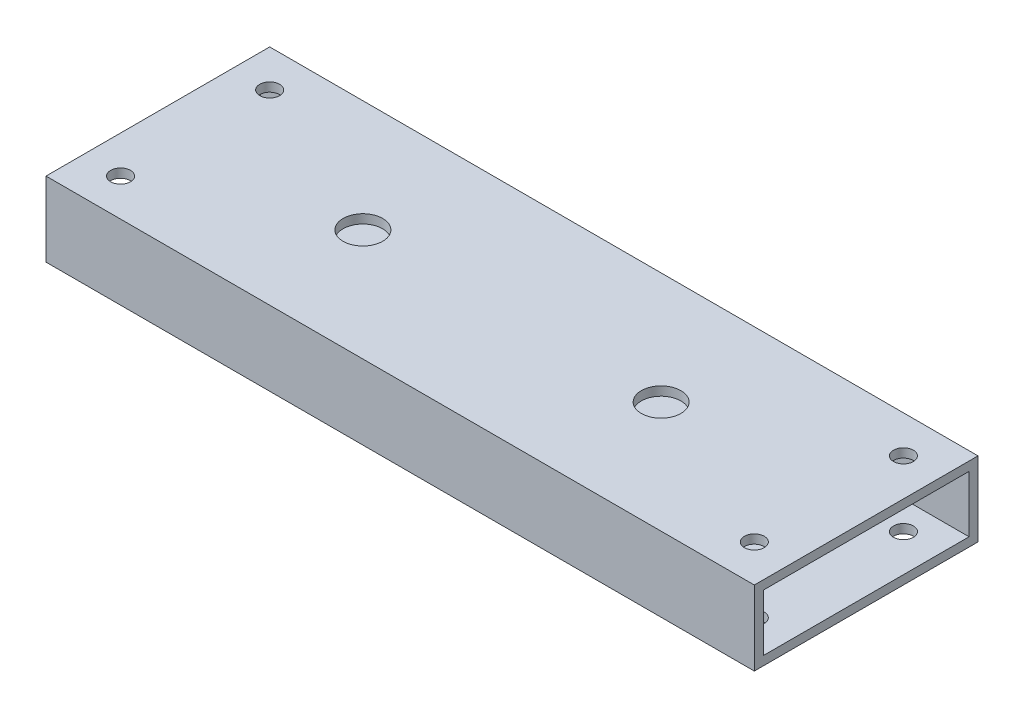
ISO-10303-21;
HEADER;
FILE_DESCRIPTION(('STEP AP214'),'2;1');
FILE_NAME('part.step','',(''),(''),'','','');
FILE_SCHEMA(('AUTOMOTIVE_DESIGN { 1 0 10303 214 1 1 1 1 }'));
ENDSEC;
DATA;
#1=APPLICATION_CONTEXT('core data for automotive mechanical design processes');
#2=APPLICATION_PROTOCOL_DEFINITION('international standard','automotive_design',2000,#1);
#3=PRODUCT_CONTEXT('',#1,'mechanical');
#4=PRODUCT('Part','Part','',(#3));
#5=PRODUCT_RELATED_PRODUCT_CATEGORY('part','',(#4));
#6=PRODUCT_DEFINITION_FORMATION('','',#4);
#7=PRODUCT_DEFINITION_CONTEXT('part definition',#1,'design');
#8=PRODUCT_DEFINITION('design','',#6,#7);
#9=PRODUCT_DEFINITION_SHAPE('','',#8);
#10=(LENGTH_UNIT() NAMED_UNIT(*) SI_UNIT(.MILLI.,.METRE.));
#11=(NAMED_UNIT(*) PLANE_ANGLE_UNIT() SI_UNIT($,.RADIAN.));
#12=(NAMED_UNIT(*) SI_UNIT($,.STERADIAN.) SOLID_ANGLE_UNIT());
#13=UNCERTAINTY_MEASURE_WITH_UNIT(LENGTH_MEASURE(1.E-05),#10,'distance_accuracy_value','');
#14=(GEOMETRIC_REPRESENTATION_CONTEXT(3) GLOBAL_UNCERTAINTY_ASSIGNED_CONTEXT((#13)) GLOBAL_UNIT_ASSIGNED_CONTEXT((#10,
#11,#12)) REPRESENTATION_CONTEXT('',''));
#15=CARTESIAN_POINT('',(0.,0.,0.));
#16=DIRECTION('',(0.,0.,1.));
#17=DIRECTION('',(1.,0.,0.));
#18=AXIS2_PLACEMENT_3D('',#15,#16,#17);
#19=CARTESIAN_POINT('',(-120.65,-9.652,-35.052));
#20=DIRECTION('',(0.,0.,1.));
#21=DIRECTION('',(1.,0.,0.));
#22=AXIS2_PLACEMENT_3D('',#19,#20,#21);
#23=PLANE('',#22);
#24=DIRECTION('',(0.,-1.,0.));
#25=VECTOR('',#24,1.);
#26=CARTESIAN_POINT('',(120.65,-9.652,-35.052));
#27=LINE('',#26,#25);
#28=CARTESIAN_POINT('',(120.65,9.652,-35.052));
#29=VERTEX_POINT('',#28);
#30=CARTESIAN_POINT('',(120.65,-9.652,-35.052));
#31=VERTEX_POINT('',#30);
#32=EDGE_CURVE('E155',#29,#31,#27,.T.);
#33=ORIENTED_EDGE('',*,*,#32,.F.);
#34=DIRECTION('',(1.,0.,0.));
#35=VECTOR('',#34,1.);
#36=CARTESIAN_POINT('',(-120.65,9.652,-35.052));
#37=LINE('',#36,#35);
#38=CARTESIAN_POINT('',(-120.65,9.652,-35.052));
#39=VERTEX_POINT('',#38);
#40=EDGE_CURVE('E12',#39,#29,#37,.T.);
#41=ORIENTED_EDGE('',*,*,#40,.F.);
#42=DIRECTION('',(0.,-1.,0.));
#43=VECTOR('',#42,1.);
#44=CARTESIAN_POINT('',(-120.65,-9.652,-35.052));
#45=LINE('',#44,#43);
#46=CARTESIAN_POINT('',(-120.65,-9.652,-35.052));
#47=VERTEX_POINT('',#46);
#48=EDGE_CURVE('E136',#39,#47,#45,.T.);
#49=ORIENTED_EDGE('',*,*,#48,.T.);
#50=DIRECTION('',(1.,0.,0.));
#51=VECTOR('',#50,1.);
#52=CARTESIAN_POINT('',(-120.65,-9.652,-35.052));
#53=LINE('',#52,#51);
#54=EDGE_CURVE('E67',#47,#31,#53,.T.);
#55=ORIENTED_EDGE('',*,*,#54,.T.);
#56=EDGE_LOOP('',(#33,#41,#49,#55));
#57=FACE_BOUND('',#56,.T.);
#58=ADVANCED_FACE('F48',(#57),#23,.T.);
#59=CARTESIAN_POINT('',(-120.65,9.652,-35.052));
#60=DIRECTION('',(0.,-1.,0.));
#61=DIRECTION('',(0.,0.,-1.));
#62=AXIS2_PLACEMENT_3D('',#59,#60,#61);
#63=PLANE('',#62);
#64=CARTESIAN_POINT('',(-107.95,9.652,25.4));
#65=DIRECTION('',(0.,-1.,0.));
#66=DIRECTION('',(0.,0.,-1.));
#67=AXIS2_PLACEMENT_3D('',#64,#65,#66);
#68=CIRCLE('',#67,3.3782);
#69=CARTESIAN_POINT('',(-107.95,9.652,22.0218));
#70=VERTEX_POINT('',#69);
#71=EDGE_CURVE('E200',#70,#70,#68,.T.);
#72=ORIENTED_EDGE('',*,*,#71,.F.);
#73=EDGE_LOOP('',(#72));
#74=FACE_BOUND('',#73,.T.);
#75=CARTESIAN_POINT('',(-107.95,9.652,-25.4));
#76=DIRECTION('',(0.,-1.,0.));
#77=DIRECTION('',(0.,0.,-1.));
#78=AXIS2_PLACEMENT_3D('',#75,#76,#77);
#79=CIRCLE('',#78,3.3782);
#80=CARTESIAN_POINT('',(-107.95,9.652,-28.7782));
#81=VERTEX_POINT('',#80);
#82=EDGE_CURVE('E187',#81,#81,#79,.T.);
#83=ORIENTED_EDGE('',*,*,#82,.F.);
#84=EDGE_LOOP('',(#83));
#85=FACE_BOUND('',#84,.T.);
#86=CARTESIAN_POINT('',(107.95,9.652,-25.4));
#87=DIRECTION('',(0.,-1.,0.));
#88=DIRECTION('',(0.,0.,-1.));
#89=AXIS2_PLACEMENT_3D('',#86,#87,#88);
#90=CIRCLE('',#89,3.3782);
#91=CARTESIAN_POINT('',(107.95,9.652,-28.7782));
#92=VERTEX_POINT('',#91);
#93=EDGE_CURVE('E183',#92,#92,#90,.T.);
#94=ORIENTED_EDGE('',*,*,#93,.F.);
#95=EDGE_LOOP('',(#94));
#96=FACE_BOUND('',#95,.T.);
#97=CARTESIAN_POINT('',(107.95,9.652,25.4));
#98=DIRECTION('',(0.,-1.,0.));
#99=DIRECTION('',(0.,0.,-1.));
#100=AXIS2_PLACEMENT_3D('',#97,#98,#99);
#101=CIRCLE('',#100,3.3782);
#102=CARTESIAN_POINT('',(107.95,9.652,22.0218));
#103=VERTEX_POINT('',#102);
#104=EDGE_CURVE('E219',#103,#103,#101,.T.);
#105=ORIENTED_EDGE('',*,*,#104,.F.);
#106=EDGE_LOOP('',(#105));
#107=FACE_BOUND('',#106,.T.);
#108=CARTESIAN_POINT('',(-50.8,9.652,0.));
#109=DIRECTION('',(0.,-1.,0.));
#110=DIRECTION('',(0.,0.,-1.));
#111=AXIS2_PLACEMENT_3D('',#108,#109,#110);
#112=CIRCLE('',#111,6.74624);
#113=CARTESIAN_POINT('',(-50.8,9.652,-6.74624000000001));
#114=VERTEX_POINT('',#113);
#115=EDGE_CURVE('E180',#114,#114,#112,.T.);
#116=ORIENTED_EDGE('',*,*,#115,.F.);
#117=EDGE_LOOP('',(#116));
#118=FACE_BOUND('',#117,.T.);
#119=CARTESIAN_POINT('',(50.8,9.652,0.));
#120=DIRECTION('',(0.,-1.,0.));
#121=DIRECTION('',(0.,0.,-1.));
#122=AXIS2_PLACEMENT_3D('',#119,#120,#121);
#123=CIRCLE('',#122,6.74624);
#124=CARTESIAN_POINT('',(50.8,9.652,-6.74623999999998));
#125=VERTEX_POINT('',#124);
#126=EDGE_CURVE('E149',#125,#125,#123,.T.);
#127=ORIENTED_EDGE('',*,*,#126,.F.);
#128=EDGE_LOOP('',(#127));
#129=FACE_BOUND('',#128,.T.);
#130=DIRECTION('',(0.,0.,-1.));
#131=VECTOR('',#130,1.);
#132=CARTESIAN_POINT('',(120.65,9.652,-35.052));
#133=LINE('',#132,#131);
#134=CARTESIAN_POINT('',(120.65,9.652,35.052));
#135=VERTEX_POINT('',#134);
#136=EDGE_CURVE('E125',#135,#29,#133,.T.);
#137=ORIENTED_EDGE('',*,*,#136,.F.);
#138=DIRECTION('',(1.,0.,0.));
#139=VECTOR('',#138,1.);
#140=CARTESIAN_POINT('',(-120.65,9.652,35.052));
#141=LINE('',#140,#139);
#142=CARTESIAN_POINT('',(-120.65,9.652,35.052));
#143=VERTEX_POINT('',#142);
#144=EDGE_CURVE('E58',#143,#135,#141,.T.);
#145=ORIENTED_EDGE('',*,*,#144,.F.);
#146=DIRECTION('',(0.,0.,-1.));
#147=VECTOR('',#146,1.);
#148=CARTESIAN_POINT('',(-120.65,9.652,-35.052));
#149=LINE('',#148,#147);
#150=EDGE_CURVE('E123',#143,#39,#149,.T.);
#151=ORIENTED_EDGE('',*,*,#150,.T.);
#152=ORIENTED_EDGE('',*,*,#40,.T.);
#153=EDGE_LOOP('',(#137,#145,#151,#152));
#154=FACE_BOUND('',#153,.T.);
#155=ADVANCED_FACE('F122',(#74,#85,#96,#107,#118,#129,#154),#63,.T.);
#156=CARTESIAN_POINT('',(-120.65,-9.652,35.052));
#157=DIRECTION('',(0.,0.,-1.));
#158=DIRECTION('',(0.,1.,0.));
#159=AXIS2_PLACEMENT_3D('',#156,#157,#158);
#160=PLANE('',#159);
#161=DIRECTION('',(0.,1.,0.));
#162=VECTOR('',#161,1.);
#163=CARTESIAN_POINT('',(120.65,-9.652,35.052));
#164=LINE('',#163,#162);
#165=CARTESIAN_POINT('',(120.65,-9.652,35.052));
#166=VERTEX_POINT('',#165);
#167=EDGE_CURVE('E158',#166,#135,#164,.T.);
#168=ORIENTED_EDGE('',*,*,#167,.F.);
#169=DIRECTION('',(1.,0.,0.));
#170=VECTOR('',#169,1.);
#171=CARTESIAN_POINT('',(-120.65,-9.652,35.052));
#172=LINE('',#171,#170);
#173=CARTESIAN_POINT('',(-120.65,-9.652,35.052));
#174=VERTEX_POINT('',#173);
#175=EDGE_CURVE('E92',#174,#166,#172,.T.);
#176=ORIENTED_EDGE('',*,*,#175,.F.);
#177=DIRECTION('',(0.,1.,0.));
#178=VECTOR('',#177,1.);
#179=CARTESIAN_POINT('',(-120.65,-9.652,35.052));
#180=LINE('',#179,#178);
#181=EDGE_CURVE('E135',#174,#143,#180,.T.);
#182=ORIENTED_EDGE('',*,*,#181,.T.);
#183=ORIENTED_EDGE('',*,*,#144,.T.);
#184=EDGE_LOOP('',(#168,#176,#182,#183));
#185=FACE_BOUND('',#184,.T.);
#186=ADVANCED_FACE('F138',(#185),#160,.T.);
#187=CARTESIAN_POINT('',(-120.65,-12.7,38.1));
#188=DIRECTION('',(0.,0.,-1.));
#189=DIRECTION('',(-1.,0.,0.));
#190=AXIS2_PLACEMENT_3D('',#187,#188,#189);
#191=PLANE('',#190);
#192=DIRECTION('',(0.,1.,0.));
#193=VECTOR('',#192,1.);
#194=CARTESIAN_POINT('',(120.65,-12.7,38.1));
#195=LINE('',#194,#193);
#196=CARTESIAN_POINT('',(120.65,-12.7,38.1));
#197=VERTEX_POINT('',#196);
#198=CARTESIAN_POINT('',(120.65,12.7,38.1));
#199=VERTEX_POINT('',#198);
#200=EDGE_CURVE('E145',#197,#199,#195,.T.);
#201=ORIENTED_EDGE('',*,*,#200,.T.);
#202=DIRECTION('',(1.,0.,0.));
#203=VECTOR('',#202,1.);
#204=CARTESIAN_POINT('',(-120.65,12.7,38.1));
#205=LINE('',#204,#203);
#206=CARTESIAN_POINT('',(-120.65,12.7,38.1));
#207=VERTEX_POINT('',#206);
#208=EDGE_CURVE('E165',#207,#199,#205,.T.);
#209=ORIENTED_EDGE('',*,*,#208,.F.);
#210=DIRECTION('',(0.,1.,0.));
#211=VECTOR('',#210,1.);
#212=CARTESIAN_POINT('',(-120.65,-12.7,38.1));
#213=LINE('',#212,#211);
#214=CARTESIAN_POINT('',(-120.65,-12.7,38.1));
#215=VERTEX_POINT('',#214);
#216=EDGE_CURVE('E163',#215,#207,#213,.T.);
#217=ORIENTED_EDGE('',*,*,#216,.F.);
#218=DIRECTION('',(1.,0.,0.));
#219=VECTOR('',#218,1.);
#220=CARTESIAN_POINT('',(-120.65,-12.7,38.1));
#221=LINE('',#220,#219);
#222=EDGE_CURVE('E141',#215,#197,#221,.T.);
#223=ORIENTED_EDGE('',*,*,#222,.T.);
#224=EDGE_LOOP('',(#201,#209,#217,#223));
#225=FACE_BOUND('',#224,.T.);
#226=ADVANCED_FACE('F50',(#225),#191,.F.);
#227=CARTESIAN_POINT('',(-120.65,12.7,-38.1));
#228=DIRECTION('',(0.,-1.,0.));
#229=DIRECTION('',(0.,0.,-1.));
#230=AXIS2_PLACEMENT_3D('',#227,#228,#229);
#231=PLANE('',#230);
#232=CARTESIAN_POINT('',(-107.95,12.7,25.4));
#233=DIRECTION('',(0.,-1.,0.));
#234=DIRECTION('',(0.,0.,-1.));
#235=AXIS2_PLACEMENT_3D('',#232,#233,#234);
#236=CIRCLE('',#235,3.3782);
#237=CARTESIAN_POINT('',(-107.95,12.7,22.0218));
#238=VERTEX_POINT('',#237);
#239=EDGE_CURVE('E283',#238,#238,#236,.T.);
#240=ORIENTED_EDGE('',*,*,#239,.T.);
#241=EDGE_LOOP('',(#240));
#242=FACE_BOUND('',#241,.T.);
#243=CARTESIAN_POINT('',(-107.95,12.7,-25.4));
#244=DIRECTION('',(0.,-1.,0.));
#245=DIRECTION('',(0.,0.,-1.));
#246=AXIS2_PLACEMENT_3D('',#243,#244,#245);
#247=CIRCLE('',#246,3.3782);
#248=CARTESIAN_POINT('',(-107.95,12.7,-28.7782));
#249=VERTEX_POINT('',#248);
#250=EDGE_CURVE('E188',#249,#249,#247,.T.);
#251=ORIENTED_EDGE('',*,*,#250,.T.);
#252=EDGE_LOOP('',(#251));
#253=FACE_BOUND('',#252,.T.);
#254=CARTESIAN_POINT('',(107.95,12.7,-25.4));
#255=DIRECTION('',(0.,-1.,0.));
#256=DIRECTION('',(0.,0.,-1.));
#257=AXIS2_PLACEMENT_3D('',#254,#255,#256);
#258=CIRCLE('',#257,3.3782);
#259=CARTESIAN_POINT('',(107.95,12.7,-28.7782));
#260=VERTEX_POINT('',#259);
#261=EDGE_CURVE('E184',#260,#260,#258,.T.);
#262=ORIENTED_EDGE('',*,*,#261,.T.);
#263=EDGE_LOOP('',(#262));
#264=FACE_BOUND('',#263,.T.);
#265=CARTESIAN_POINT('',(107.95,12.7,25.4));
#266=DIRECTION('',(0.,-1.,0.));
#267=DIRECTION('',(0.,0.,-1.));
#268=AXIS2_PLACEMENT_3D('',#265,#266,#267);
#269=CIRCLE('',#268,3.3782);
#270=CARTESIAN_POINT('',(107.95,12.7,22.0218));
#271=VERTEX_POINT('',#270);
#272=EDGE_CURVE('E213',#271,#271,#269,.T.);
#273=ORIENTED_EDGE('',*,*,#272,.T.);
#274=EDGE_LOOP('',(#273));
#275=FACE_BOUND('',#274,.T.);
#276=CARTESIAN_POINT('',(-50.8,12.7,0.));
#277=DIRECTION('',(0.,-1.,0.));
#278=DIRECTION('',(0.,0.,-1.));
#279=AXIS2_PLACEMENT_3D('',#276,#277,#278);
#280=CIRCLE('',#279,6.74623999999999);
#281=CARTESIAN_POINT('',(-50.8,12.7,-6.74624000000001));
#282=VERTEX_POINT('',#281);
#283=EDGE_CURVE('E225',#282,#282,#280,.T.);
#284=ORIENTED_EDGE('',*,*,#283,.T.);
#285=EDGE_LOOP('',(#284));
#286=FACE_BOUND('',#285,.T.);
#287=CARTESIAN_POINT('',(50.8,12.7,0.));
#288=DIRECTION('',(0.,-1.,0.));
#289=DIRECTION('',(0.,0.,-1.));
#290=AXIS2_PLACEMENT_3D('',#287,#288,#289);
#291=CIRCLE('',#290,6.74623999999999);
#292=CARTESIAN_POINT('',(50.8,12.7,-6.74623999999998));
#293=VERTEX_POINT('',#292);
#294=EDGE_CURVE('E232',#293,#293,#291,.T.);
#295=ORIENTED_EDGE('',*,*,#294,.T.);
#296=EDGE_LOOP('',(#295));
#297=FACE_BOUND('',#296,.T.);
#298=DIRECTION('',(0.,0.,-1.));
#299=VECTOR('',#298,1.);
#300=CARTESIAN_POINT('',(120.65,12.7,-38.1));
#301=LINE('',#300,#299);
#302=CARTESIAN_POINT('',(120.65,12.7,-38.1));
#303=VERTEX_POINT('',#302);
#304=EDGE_CURVE('E148',#199,#303,#301,.T.);
#305=ORIENTED_EDGE('',*,*,#304,.T.);
#306=DIRECTION('',(1.,0.,0.));
#307=VECTOR('',#306,1.);
#308=CARTESIAN_POINT('',(-120.65,12.7,-38.1));
#309=LINE('',#308,#307);
#310=CARTESIAN_POINT('',(-120.65,12.7,-38.1));
#311=VERTEX_POINT('',#310);
#312=EDGE_CURVE('E172',#311,#303,#309,.T.);
#313=ORIENTED_EDGE('',*,*,#312,.F.);
#314=DIRECTION('',(0.,0.,-1.));
#315=VECTOR('',#314,1.);
#316=CARTESIAN_POINT('',(-120.65,12.7,-38.1));
#317=LINE('',#316,#315);
#318=EDGE_CURVE('E105',#207,#311,#317,.T.);
#319=ORIENTED_EDGE('',*,*,#318,.F.);
#320=ORIENTED_EDGE('',*,*,#208,.T.);
#321=EDGE_LOOP('',(#305,#313,#319,#320));
#322=FACE_BOUND('',#321,.T.);
#323=ADVANCED_FACE('F273',(#242,#253,#264,#275,#286,#297,#322),#231,.F.);
#324=CARTESIAN_POINT('',(-120.65,-12.7,-38.1));
#325=DIRECTION('',(0.,0.,1.));
#326=DIRECTION('',(1.,0.,0.));
#327=AXIS2_PLACEMENT_3D('',#324,#325,#326);
#328=PLANE('',#327);
#329=DIRECTION('',(0.,-1.,0.));
#330=VECTOR('',#329,1.);
#331=CARTESIAN_POINT('',(120.65,-12.7,-38.1));
#332=LINE('',#331,#330);
#333=CARTESIAN_POINT('',(120.65,-12.7,-38.1));
#334=VERTEX_POINT('',#333);
#335=EDGE_CURVE('E151',#303,#334,#332,.T.);
#336=ORIENTED_EDGE('',*,*,#335,.T.);
#337=DIRECTION('',(1.,0.,0.));
#338=VECTOR('',#337,1.);
#339=CARTESIAN_POINT('',(-120.65,-12.7,-38.1));
#340=LINE('',#339,#338);
#341=CARTESIAN_POINT('',(-120.65,-12.7,-38.1));
#342=VERTEX_POINT('',#341);
#343=EDGE_CURVE('E169',#342,#334,#340,.T.);
#344=ORIENTED_EDGE('',*,*,#343,.F.);
#345=DIRECTION('',(0.,-1.,0.));
#346=VECTOR('',#345,1.);
#347=CARTESIAN_POINT('',(-120.65,-12.7,-38.1));
#348=LINE('',#347,#346);
#349=EDGE_CURVE('E242',#311,#342,#348,.T.);
#350=ORIENTED_EDGE('',*,*,#349,.F.);
#351=ORIENTED_EDGE('',*,*,#312,.T.);
#352=EDGE_LOOP('',(#336,#344,#350,#351));
#353=FACE_BOUND('',#352,.T.);
#354=ADVANCED_FACE('F257',(#353),#328,.F.);
#355=CARTESIAN_POINT('',(-120.65,-12.7,-38.1));
#356=DIRECTION('',(0.,1.,0.));
#357=DIRECTION('',(0.,0.,1.));
#358=AXIS2_PLACEMENT_3D('',#355,#356,#357);
#359=PLANE('',#358);
#360=CARTESIAN_POINT('',(-107.95,-12.7,25.4));
#361=DIRECTION('',(0.,-1.,0.));
#362=DIRECTION('',(0.,0.,-1.));
#363=AXIS2_PLACEMENT_3D('',#360,#361,#362);
#364=CIRCLE('',#363,3.3782);
#365=CARTESIAN_POINT('',(-107.95,-12.7,22.0218));
#366=VERTEX_POINT('',#365);
#367=EDGE_CURVE('E352',#366,#366,#364,.T.);
#368=ORIENTED_EDGE('',*,*,#367,.F.);
#369=EDGE_LOOP('',(#368));
#370=FACE_BOUND('',#369,.T.);
#371=CARTESIAN_POINT('',(-107.95,-12.7,-25.4));
#372=DIRECTION('',(0.,-1.,0.));
#373=DIRECTION('',(0.,0.,-1.));
#374=AXIS2_PLACEMENT_3D('',#371,#372,#373);
#375=CIRCLE('',#374,3.3782);
#376=CARTESIAN_POINT('',(-107.95,-12.7,-28.7782));
#377=VERTEX_POINT('',#376);
#378=EDGE_CURVE('E195',#377,#377,#375,.T.);
#379=ORIENTED_EDGE('',*,*,#378,.F.);
#380=EDGE_LOOP('',(#379));
#381=FACE_BOUND('',#380,.T.);
#382=CARTESIAN_POINT('',(107.95,-12.7,-25.4));
#383=DIRECTION('',(0.,-1.,0.));
#384=DIRECTION('',(0.,0.,-1.));
#385=AXIS2_PLACEMENT_3D('',#382,#383,#384);
#386=CIRCLE('',#385,3.3782);
#387=CARTESIAN_POINT('',(107.95,-12.7,-28.7782));
#388=VERTEX_POINT('',#387);
#389=EDGE_CURVE('E192',#388,#388,#386,.T.);
#390=ORIENTED_EDGE('',*,*,#389,.F.);
#391=EDGE_LOOP('',(#390));
#392=FACE_BOUND('',#391,.T.);
#393=CARTESIAN_POINT('',(107.95,-12.7,25.4));
#394=DIRECTION('',(0.,-1.,0.));
#395=DIRECTION('',(0.,0.,-1.));
#396=AXIS2_PLACEMENT_3D('',#393,#394,#395);
#397=CIRCLE('',#396,3.3782);
#398=CARTESIAN_POINT('',(107.95,-12.7,22.0218));
#399=VERTEX_POINT('',#398);
#400=EDGE_CURVE('E210',#399,#399,#397,.T.);
#401=ORIENTED_EDGE('',*,*,#400,.F.);
#402=EDGE_LOOP('',(#401));
#403=FACE_BOUND('',#402,.T.);
#404=CARTESIAN_POINT('',(-50.8,-12.7,0.));
#405=DIRECTION('',(0.,-1.,0.));
#406=DIRECTION('',(0.,0.,-1.));
#407=AXIS2_PLACEMENT_3D('',#404,#405,#406);
#408=CIRCLE('',#407,14.2875);
#409=CARTESIAN_POINT('',(-50.8,-12.7,-14.2875));
#410=VERTEX_POINT('',#409);
#411=EDGE_CURVE('E222',#410,#410,#408,.T.);
#412=ORIENTED_EDGE('',*,*,#411,.F.);
#413=EDGE_LOOP('',(#412));
#414=FACE_BOUND('',#413,.T.);
#415=CARTESIAN_POINT('',(50.8,-12.7,0.));
#416=DIRECTION('',(0.,-1.,0.));
#417=DIRECTION('',(0.,0.,-1.));
#418=AXIS2_PLACEMENT_3D('',#415,#416,#417);
#419=CIRCLE('',#418,14.2875);
#420=CARTESIAN_POINT('',(50.8,-12.7,-14.2875));
#421=VERTEX_POINT('',#420);
#422=EDGE_CURVE('E179',#421,#421,#419,.T.);
#423=ORIENTED_EDGE('',*,*,#422,.F.);
#424=EDGE_LOOP('',(#423));
#425=FACE_BOUND('',#424,.T.);
#426=DIRECTION('',(0.,0.,1.));
#427=VECTOR('',#426,1.);
#428=CARTESIAN_POINT('',(120.65,-12.7,-38.1));
#429=LINE('',#428,#427);
#430=EDGE_CURVE('E153',#334,#197,#429,.T.);
#431=ORIENTED_EDGE('',*,*,#430,.T.);
#432=ORIENTED_EDGE('',*,*,#222,.F.);
#433=DIRECTION('',(0.,0.,1.));
#434=VECTOR('',#433,1.);
#435=CARTESIAN_POINT('',(-120.65,-12.7,-38.1));
#436=LINE('',#435,#434);
#437=EDGE_CURVE('E244',#342,#215,#436,.T.);
#438=ORIENTED_EDGE('',*,*,#437,.F.);
#439=ORIENTED_EDGE('',*,*,#343,.T.);
#440=EDGE_LOOP('',(#431,#432,#438,#439));
#441=FACE_BOUND('',#440,.T.);
#442=ADVANCED_FACE('F247',(#370,#381,#392,#403,#414,#425,#441),#359,.F.);
#443=CARTESIAN_POINT('',(-120.65,-9.652,-35.052));
#444=DIRECTION('',(0.,1.,0.));
#445=DIRECTION('',(0.,0.,1.));
#446=AXIS2_PLACEMENT_3D('',#443,#444,#445);
#447=PLANE('',#446);
#448=CARTESIAN_POINT('',(-107.95,-9.652,25.4));
#449=DIRECTION('',(0.,1.,0.));
#450=DIRECTION('',(0.,0.,1.));
#451=AXIS2_PLACEMENT_3D('',#448,#449,#450);
#452=CIRCLE('',#451,3.3782);
#453=CARTESIAN_POINT('',(-107.95,-9.652,28.7782));
#454=VERTEX_POINT('',#453);
#455=EDGE_CURVE('E52',#454,#454,#452,.T.);
#456=ORIENTED_EDGE('',*,*,#455,.F.);
#457=EDGE_LOOP('',(#456));
#458=FACE_BOUND('',#457,.T.);
#459=CARTESIAN_POINT('',(-107.95,-9.652,-25.4));
#460=DIRECTION('',(0.,1.,0.));
#461=DIRECTION('',(0.,0.,1.));
#462=AXIS2_PLACEMENT_3D('',#459,#460,#461);
#463=CIRCLE('',#462,3.3782);
#464=CARTESIAN_POINT('',(-107.95,-9.652,-22.0218));
#465=VERTEX_POINT('',#464);
#466=EDGE_CURVE('E185',#465,#465,#463,.T.);
#467=ORIENTED_EDGE('',*,*,#466,.F.);
#468=EDGE_LOOP('',(#467));
#469=FACE_BOUND('',#468,.T.);
#470=CARTESIAN_POINT('',(107.95,-9.652,-25.4));
#471=DIRECTION('',(0.,1.,0.));
#472=DIRECTION('',(0.,0.,1.));
#473=AXIS2_PLACEMENT_3D('',#470,#471,#472);
#474=CIRCLE('',#473,3.3782);
#475=CARTESIAN_POINT('',(107.95,-9.652,-22.0218));
#476=VERTEX_POINT('',#475);
#477=EDGE_CURVE('E181',#476,#476,#474,.T.);
#478=ORIENTED_EDGE('',*,*,#477,.F.);
#479=EDGE_LOOP('',(#478));
#480=FACE_BOUND('',#479,.T.);
#481=CARTESIAN_POINT('',(107.95,-9.652,25.4));
#482=DIRECTION('',(0.,1.,0.));
#483=DIRECTION('',(0.,0.,1.));
#484=AXIS2_PLACEMENT_3D('',#481,#482,#483);
#485=CIRCLE('',#484,3.3782);
#486=CARTESIAN_POINT('',(107.95,-9.652,28.7782));
#487=VERTEX_POINT('',#486);
#488=EDGE_CURVE('E216',#487,#487,#485,.T.);
#489=ORIENTED_EDGE('',*,*,#488,.F.);
#490=EDGE_LOOP('',(#489));
#491=FACE_BOUND('',#490,.T.);
#492=CARTESIAN_POINT('',(-50.8,-9.652,0.));
#493=DIRECTION('',(0.,1.,0.));
#494=DIRECTION('',(0.,0.,1.));
#495=AXIS2_PLACEMENT_3D('',#492,#493,#494);
#496=CIRCLE('',#495,14.2875);
#497=CARTESIAN_POINT('',(-50.8,-9.652,14.2875));
#498=VERTEX_POINT('',#497);
#499=EDGE_CURVE('E176',#498,#498,#496,.T.);
#500=ORIENTED_EDGE('',*,*,#499,.F.);
#501=EDGE_LOOP('',(#500));
#502=FACE_BOUND('',#501,.T.);
#503=CARTESIAN_POINT('',(50.8,-9.652,0.));
#504=DIRECTION('',(0.,1.,0.));
#505=DIRECTION('',(0.,0.,1.));
#506=AXIS2_PLACEMENT_3D('',#503,#504,#505);
#507=CIRCLE('',#506,14.2875);
#508=CARTESIAN_POINT('',(50.8,-9.652,14.2875));
#509=VERTEX_POINT('',#508);
#510=EDGE_CURVE('E235',#509,#509,#507,.T.);
#511=ORIENTED_EDGE('',*,*,#510,.F.);
#512=EDGE_LOOP('',(#511));
#513=FACE_BOUND('',#512,.T.);
#514=DIRECTION('',(0.,0.,1.));
#515=VECTOR('',#514,1.);
#516=CARTESIAN_POINT('',(120.65,-9.652,-35.052));
#517=LINE('',#516,#515);
#518=EDGE_CURVE('E160',#31,#166,#517,.T.);
#519=ORIENTED_EDGE('',*,*,#518,.F.);
#520=ORIENTED_EDGE('',*,*,#54,.F.);
#521=DIRECTION('',(0.,0.,1.));
#522=VECTOR('',#521,1.);
#523=CARTESIAN_POINT('',(-120.65,-9.652,-35.052));
#524=LINE('',#523,#522);
#525=EDGE_CURVE('E139',#47,#174,#524,.T.);
#526=ORIENTED_EDGE('',*,*,#525,.T.);
#527=ORIENTED_EDGE('',*,*,#175,.T.);
#528=EDGE_LOOP('',(#519,#520,#526,#527));
#529=FACE_BOUND('',#528,.T.);
#530=ADVANCED_FACE('F245',(#458,#469,#480,#491,#502,#513,#529),#447,.T.);
#531=CARTESIAN_POINT('',(-120.65,0.,0.));
#532=DIRECTION('',(1.,0.,0.));
#533=DIRECTION('',(0.,0.,-1.));
#534=AXIS2_PLACEMENT_3D('',#531,#532,#533);
#535=PLANE('',#534);
#536=ORIENTED_EDGE('',*,*,#216,.T.);
#537=ORIENTED_EDGE('',*,*,#318,.T.);
#538=ORIENTED_EDGE('',*,*,#349,.T.);
#539=ORIENTED_EDGE('',*,*,#437,.T.);
#540=EDGE_LOOP('',(#536,#537,#538,#539));
#541=FACE_BOUND('',#540,.T.);
#542=ORIENTED_EDGE('',*,*,#48,.F.);
#543=ORIENTED_EDGE('',*,*,#150,.F.);
#544=ORIENTED_EDGE('',*,*,#181,.F.);
#545=ORIENTED_EDGE('',*,*,#525,.F.);
#546=EDGE_LOOP('',(#542,#543,#544,#545));
#547=FACE_BOUND('',#546,.T.);
#548=ADVANCED_FACE('F133',(#541,#547),#535,.F.);
#549=CARTESIAN_POINT('',(120.65,0.,0.));
#550=DIRECTION('',(1.,0.,0.));
#551=DIRECTION('',(0.,0.,-1.));
#552=AXIS2_PLACEMENT_3D('',#549,#550,#551);
#553=PLANE('',#552);
#554=ORIENTED_EDGE('',*,*,#200,.F.);
#555=ORIENTED_EDGE('',*,*,#430,.F.);
#556=ORIENTED_EDGE('',*,*,#335,.F.);
#557=ORIENTED_EDGE('',*,*,#304,.F.);
#558=EDGE_LOOP('',(#554,#555,#556,#557));
#559=FACE_BOUND('',#558,.T.);
#560=ORIENTED_EDGE('',*,*,#32,.T.);
#561=ORIENTED_EDGE('',*,*,#518,.T.);
#562=ORIENTED_EDGE('',*,*,#167,.T.);
#563=ORIENTED_EDGE('',*,*,#136,.T.);
#564=EDGE_LOOP('',(#560,#561,#562,#563));
#565=FACE_BOUND('',#564,.T.);
#566=ADVANCED_FACE('F254',(#559,#565),#553,.T.);
#567=CARTESIAN_POINT('',(50.8,-12.7,0.));
#568=DIRECTION('',(0.,-1.,0.));
#569=DIRECTION('',(0.,0.,-1.));
#570=AXIS2_PLACEMENT_3D('',#567,#568,#569);
#571=CYLINDRICAL_SURFACE('',#570,14.2875);
#572=ORIENTED_EDGE('',*,*,#510,.T.);
#573=EDGE_LOOP('',(#572));
#574=FACE_BOUND('',#573,.T.);
#575=ORIENTED_EDGE('',*,*,#422,.T.);
#576=EDGE_LOOP('',(#575));
#577=FACE_BOUND('',#576,.T.);
#578=ADVANCED_FACE('F305',(#574,#577),#571,.F.);
#579=CARTESIAN_POINT('',(50.8,-12.7,0.));
#580=DIRECTION('',(0.,-1.,0.));
#581=DIRECTION('',(0.,0.,-1.));
#582=AXIS2_PLACEMENT_3D('',#579,#580,#581);
#583=CYLINDRICAL_SURFACE('',#582,6.74624);
#584=ORIENTED_EDGE('',*,*,#126,.T.);
#585=EDGE_LOOP('',(#584));
#586=FACE_BOUND('',#585,.T.);
#587=ORIENTED_EDGE('',*,*,#294,.F.);
#588=EDGE_LOOP('',(#587));
#589=FACE_BOUND('',#588,.T.);
#590=ADVANCED_FACE('F309',(#586,#589),#583,.F.);
#591=CARTESIAN_POINT('',(-50.8,-12.7,0.));
#592=DIRECTION('',(0.,-1.,0.));
#593=DIRECTION('',(0.,0.,-1.));
#594=AXIS2_PLACEMENT_3D('',#591,#592,#593);
#595=CYLINDRICAL_SURFACE('',#594,6.74624);
#596=ORIENTED_EDGE('',*,*,#115,.T.);
#597=EDGE_LOOP('',(#596));
#598=FACE_BOUND('',#597,.T.);
#599=ORIENTED_EDGE('',*,*,#283,.F.);
#600=EDGE_LOOP('',(#599));
#601=FACE_BOUND('',#600,.T.);
#602=ADVANCED_FACE('F314',(#598,#601),#595,.F.);
#603=CARTESIAN_POINT('',(-50.8,-12.7,0.));
#604=DIRECTION('',(0.,-1.,0.));
#605=DIRECTION('',(0.,0.,-1.));
#606=AXIS2_PLACEMENT_3D('',#603,#604,#605);
#607=CYLINDRICAL_SURFACE('',#606,14.2875);
#608=ORIENTED_EDGE('',*,*,#499,.T.);
#609=EDGE_LOOP('',(#608));
#610=FACE_BOUND('',#609,.T.);
#611=ORIENTED_EDGE('',*,*,#411,.T.);
#612=EDGE_LOOP('',(#611));
#613=FACE_BOUND('',#612,.T.);
#614=ADVANCED_FACE('F319',(#610,#613),#607,.F.);
#615=CARTESIAN_POINT('',(107.95,-12.7,25.4));
#616=DIRECTION('',(0.,-1.,0.));
#617=DIRECTION('',(0.,0.,-1.));
#618=AXIS2_PLACEMENT_3D('',#615,#616,#617);
#619=CYLINDRICAL_SURFACE('',#618,3.3782);
#620=ORIENTED_EDGE('',*,*,#104,.T.);
#621=EDGE_LOOP('',(#620));
#622=FACE_BOUND('',#621,.T.);
#623=ORIENTED_EDGE('',*,*,#272,.F.);
#624=EDGE_LOOP('',(#623));
#625=FACE_BOUND('',#624,.T.);
#626=ADVANCED_FACE('F323',(#622,#625),#619,.F.);
#627=ORIENTED_EDGE('',*,*,#488,.T.);
#628=EDGE_LOOP('',(#627));
#629=FACE_BOUND('',#628,.T.);
#630=ORIENTED_EDGE('',*,*,#400,.T.);
#631=EDGE_LOOP('',(#630));
#632=FACE_BOUND('',#631,.T.);
#633=ADVANCED_FACE('F325',(#629,#632),#619,.F.);
#634=CARTESIAN_POINT('',(107.95,-12.7,-25.4));
#635=DIRECTION('',(0.,-1.,0.));
#636=DIRECTION('',(0.,0.,-1.));
#637=AXIS2_PLACEMENT_3D('',#634,#635,#636);
#638=CYLINDRICAL_SURFACE('',#637,3.3782);
#639=ORIENTED_EDGE('',*,*,#477,.T.);
#640=EDGE_LOOP('',(#639));
#641=FACE_BOUND('',#640,.T.);
#642=ORIENTED_EDGE('',*,*,#389,.T.);
#643=EDGE_LOOP('',(#642));
#644=FACE_BOUND('',#643,.T.);
#645=ADVANCED_FACE('F328',(#641,#644),#638,.F.);
#646=ORIENTED_EDGE('',*,*,#93,.T.);
#647=EDGE_LOOP('',(#646));
#648=FACE_BOUND('',#647,.T.);
#649=ORIENTED_EDGE('',*,*,#261,.F.);
#650=EDGE_LOOP('',(#649));
#651=FACE_BOUND('',#650,.T.);
#652=ADVANCED_FACE('F332',(#648,#651),#638,.F.);
#653=CARTESIAN_POINT('',(-107.95,-12.7,-25.4));
#654=DIRECTION('',(0.,-1.,0.));
#655=DIRECTION('',(0.,0.,-1.));
#656=AXIS2_PLACEMENT_3D('',#653,#654,#655);
#657=CYLINDRICAL_SURFACE('',#656,3.3782);
#658=ORIENTED_EDGE('',*,*,#466,.T.);
#659=EDGE_LOOP('',(#658));
#660=FACE_BOUND('',#659,.T.);
#661=ORIENTED_EDGE('',*,*,#378,.T.);
#662=EDGE_LOOP('',(#661));
#663=FACE_BOUND('',#662,.T.);
#664=ADVANCED_FACE('F334',(#660,#663),#657,.F.);
#665=ORIENTED_EDGE('',*,*,#82,.T.);
#666=EDGE_LOOP('',(#665));
#667=FACE_BOUND('',#666,.T.);
#668=ORIENTED_EDGE('',*,*,#250,.F.);
#669=EDGE_LOOP('',(#668));
#670=FACE_BOUND('',#669,.T.);
#671=ADVANCED_FACE('F337',(#667,#670),#657,.F.);
#672=CARTESIAN_POINT('',(-107.95,-12.7,25.4));
#673=DIRECTION('',(0.,-1.,0.));
#674=DIRECTION('',(0.,0.,-1.));
#675=AXIS2_PLACEMENT_3D('',#672,#673,#674);
#676=CYLINDRICAL_SURFACE('',#675,3.3782);
#677=ORIENTED_EDGE('',*,*,#455,.T.);
#678=EDGE_LOOP('',(#677));
#679=FACE_BOUND('',#678,.T.);
#680=ORIENTED_EDGE('',*,*,#367,.T.);
#681=EDGE_LOOP('',(#680));
#682=FACE_BOUND('',#681,.T.);
#683=ADVANCED_FACE('F338',(#679,#682),#676,.F.);
#684=ORIENTED_EDGE('',*,*,#71,.T.);
#685=EDGE_LOOP('',(#684));
#686=FACE_BOUND('',#685,.T.);
#687=ORIENTED_EDGE('',*,*,#239,.F.);
#688=EDGE_LOOP('',(#687));
#689=FACE_BOUND('',#688,.T.);
#690=ADVANCED_FACE('F340',(#686,#689),#676,.F.);
#691=CLOSED_SHELL('',(#58,#155,#186,#226,#323,#354,#442,#530,#548,#566,#578,#590,#602,#614,#626,
#633,#645,#652,#664,#671,#683,#690));
#692=MANIFOLD_SOLID_BREP('B2',#691);
#693=ADVANCED_BREP_SHAPE_REPRESENTATION('',(#18,#692),#14);
#694=SHAPE_DEFINITION_REPRESENTATION(#9,#693);
ENDSEC;
END-ISO-10303-21;
